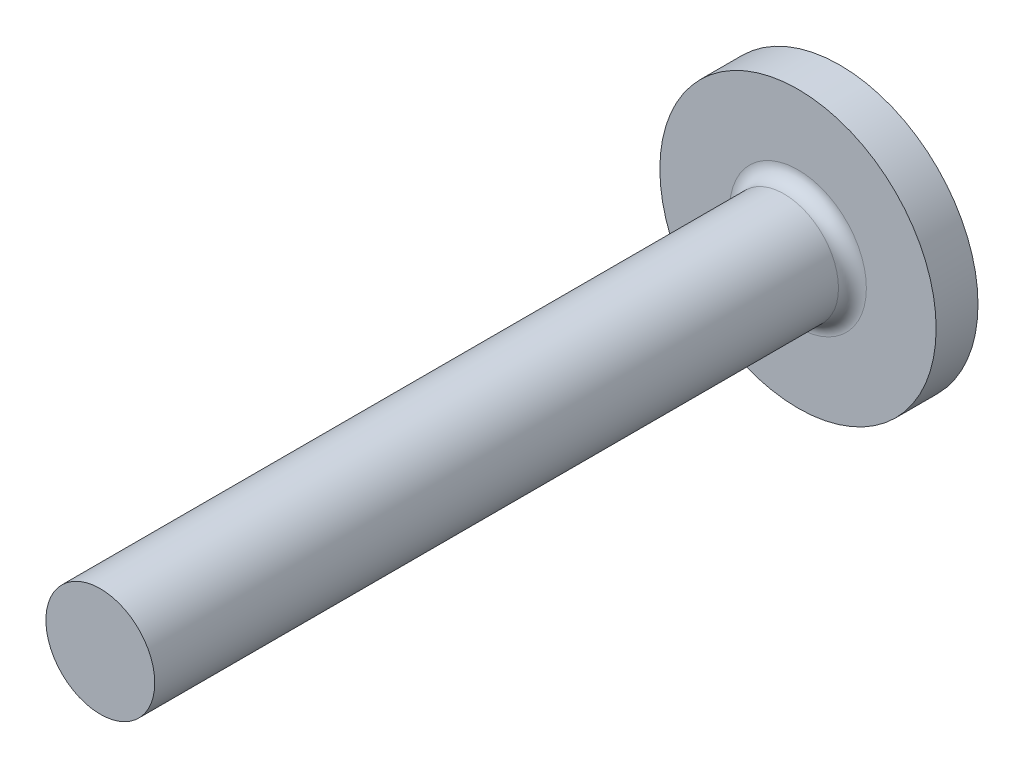
ISO-10303-21;
HEADER;
FILE_DESCRIPTION(('STEP AP214'),'2;1');
FILE_NAME('part.step','',(''),(''),'','','');
FILE_SCHEMA(('AUTOMOTIVE_DESIGN { 1 0 10303 214 1 1 1 1 }'));
ENDSEC;
DATA;
#1=APPLICATION_CONTEXT('core data for automotive mechanical design processes');
#2=APPLICATION_PROTOCOL_DEFINITION('international standard','automotive_design',2000,#1);
#3=PRODUCT_CONTEXT('',#1,'mechanical');
#4=PRODUCT('Part','Part','',(#3));
#5=PRODUCT_RELATED_PRODUCT_CATEGORY('part','',(#4));
#6=PRODUCT_DEFINITION_FORMATION('','',#4);
#7=PRODUCT_DEFINITION_CONTEXT('part definition',#1,'design');
#8=PRODUCT_DEFINITION('design','',#6,#7);
#9=PRODUCT_DEFINITION_SHAPE('','',#8);
#10=(LENGTH_UNIT() NAMED_UNIT(*) SI_UNIT(.MILLI.,.METRE.));
#11=(NAMED_UNIT(*) PLANE_ANGLE_UNIT() SI_UNIT($,.RADIAN.));
#12=(NAMED_UNIT(*) SI_UNIT($,.STERADIAN.) SOLID_ANGLE_UNIT());
#13=UNCERTAINTY_MEASURE_WITH_UNIT(LENGTH_MEASURE(1.E-05),#10,'distance_accuracy_value','');
#14=(GEOMETRIC_REPRESENTATION_CONTEXT(3) GLOBAL_UNCERTAINTY_ASSIGNED_CONTEXT((#13)) GLOBAL_UNIT_ASSIGNED_CONTEXT((#10,
#11,#12)) REPRESENTATION_CONTEXT('',''));
#15=CARTESIAN_POINT('',(0.,0.,0.));
#16=DIRECTION('',(0.,0.,1.));
#17=DIRECTION('',(1.,0.,0.));
#18=AXIS2_PLACEMENT_3D('',#15,#16,#17);
#19=CARTESIAN_POINT('',(0.,0.,50.));
#20=DIRECTION('',(0.,0.,-1.));
#21=DIRECTION('',(-1.,0.,0.));
#22=AXIS2_PLACEMENT_3D('',#19,#20,#21);
#23=CYLINDRICAL_SURFACE('',#22,3.9);
#24=CARTESIAN_POINT('',(0.,0.,1.));
#25=DIRECTION('',(0.,0.,1.));
#26=DIRECTION('',(1.,0.,0.));
#27=AXIS2_PLACEMENT_3D('',#24,#25,#26);
#28=CIRCLE('',#27,3.9);
#29=CARTESIAN_POINT('',(3.9,0.,1.));
#30=VERTEX_POINT('',#29);
#31=EDGE_CURVE('E53',#30,#30,#28,.T.);
#32=ORIENTED_EDGE('',*,*,#31,.T.);
#33=EDGE_LOOP('',(#32));
#34=FACE_BOUND('',#33,.T.);
#35=CARTESIAN_POINT('',(0.,0.,50.));
#36=DIRECTION('',(0.,0.,1.));
#37=DIRECTION('',(1.,0.,0.));
#38=AXIS2_PLACEMENT_3D('',#35,#36,#37);
#39=CIRCLE('',#38,3.9);
#40=CARTESIAN_POINT('',(3.9,0.,50.));
#41=VERTEX_POINT('',#40);
#42=EDGE_CURVE('E58',#41,#41,#39,.T.);
#43=ORIENTED_EDGE('',*,*,#42,.F.);
#44=EDGE_LOOP('',(#43));
#45=FACE_BOUND('',#44,.T.);
#46=ADVANCED_FACE('F45',(#34,#45),#23,.T.);
#47=CARTESIAN_POINT('',(0.,0.,50.));
#48=DIRECTION('',(0.,0.,1.));
#49=DIRECTION('',(1.,0.,0.));
#50=AXIS2_PLACEMENT_3D('',#47,#48,#49);
#51=PLANE('',#50);
#52=ORIENTED_EDGE('',*,*,#42,.T.);
#53=EDGE_LOOP('',(#52));
#54=FACE_BOUND('',#53,.T.);
#55=ADVANCED_FACE('F87',(#54),#51,.T.);
#56=CARTESIAN_POINT('',(0.,0.,-3.));
#57=DIRECTION('',(0.,0.,1.));
#58=DIRECTION('',(1.,0.,0.));
#59=AXIS2_PLACEMENT_3D('',#56,#57,#58);
#60=CYLINDRICAL_SURFACE('',#59,9.9);
#61=CARTESIAN_POINT('',(0.,0.,-3.));
#62=DIRECTION('',(0.,0.,1.));
#63=DIRECTION('',(1.,0.,0.));
#64=AXIS2_PLACEMENT_3D('',#61,#62,#63);
#65=CIRCLE('',#64,9.9);
#66=CARTESIAN_POINT('',(9.9,0.,-3.));
#67=VERTEX_POINT('',#66);
#68=EDGE_CURVE('E63',#67,#67,#65,.T.);
#69=ORIENTED_EDGE('',*,*,#68,.T.);
#70=EDGE_LOOP('',(#69));
#71=FACE_BOUND('',#70,.T.);
#72=CARTESIAN_POINT('',(0.,0.,0.));
#73=DIRECTION('',(0.,0.,1.));
#74=DIRECTION('',(1.,0.,0.));
#75=AXIS2_PLACEMENT_3D('',#72,#73,#74);
#76=CIRCLE('',#75,9.9);
#77=CARTESIAN_POINT('',(9.9,0.,0.));
#78=VERTEX_POINT('',#77);
#79=EDGE_CURVE('E66',#78,#78,#76,.T.);
#80=ORIENTED_EDGE('',*,*,#79,.F.);
#81=EDGE_LOOP('',(#80));
#82=FACE_BOUND('',#81,.T.);
#83=ADVANCED_FACE('F74',(#71,#82),#60,.T.);
#84=CARTESIAN_POINT('',(0.,0.,-3.));
#85=DIRECTION('',(0.,0.,1.));
#86=DIRECTION('',(1.,0.,0.));
#87=AXIS2_PLACEMENT_3D('',#84,#85,#86);
#88=PLANE('',#87);
#89=ORIENTED_EDGE('',*,*,#68,.F.);
#90=EDGE_LOOP('',(#89));
#91=FACE_BOUND('',#90,.T.);
#92=ADVANCED_FACE('F77',(#91),#88,.F.);
#93=CARTESIAN_POINT('',(0.,0.,0.));
#94=DIRECTION('',(0.,0.,1.));
#95=DIRECTION('',(1.,0.,0.));
#96=AXIS2_PLACEMENT_3D('',#93,#94,#95);
#97=PLANE('',#96);
#98=CARTESIAN_POINT('',(0.,0.,0.));
#99=DIRECTION('',(0.,0.,1.));
#100=DIRECTION('',(1.,0.,0.));
#101=AXIS2_PLACEMENT_3D('',#98,#99,#100);
#102=CIRCLE('',#101,4.9);
#103=CARTESIAN_POINT('',(4.9,0.,0.));
#104=VERTEX_POINT('',#103);
#105=EDGE_CURVE('E10',#104,#104,#102,.F.);
#106=ORIENTED_EDGE('',*,*,#105,.T.);
#107=EDGE_LOOP('',(#106));
#108=FACE_BOUND('',#107,.T.);
#109=ORIENTED_EDGE('',*,*,#79,.T.);
#110=EDGE_LOOP('',(#109));
#111=FACE_BOUND('',#110,.T.);
#112=ADVANCED_FACE('F79',(#108,#111),#97,.T.);
#113=CARTESIAN_POINT('',(0.,0.,1.));
#114=DIRECTION('',(0.,0.,1.));
#115=DIRECTION('',(1.,0.,0.));
#116=AXIS2_PLACEMENT_3D('',#113,#114,#115);
#117=TOROIDAL_SURFACE('',#116,4.9,1.);
#118=ORIENTED_EDGE('',*,*,#105,.F.);
#119=EDGE_LOOP('',(#118));
#120=FACE_BOUND('',#119,.T.);
#121=ORIENTED_EDGE('',*,*,#31,.F.);
#122=EDGE_LOOP('',(#121));
#123=FACE_BOUND('',#122,.T.);
#124=ADVANCED_FACE('F47',(#120,#123),#117,.F.);
#125=CLOSED_SHELL('',(#46,#55,#83,#92,#112,#124));
#126=MANIFOLD_SOLID_BREP('B2',#125);
#127=ADVANCED_BREP_SHAPE_REPRESENTATION('',(#18,#126),#14);
#128=SHAPE_DEFINITION_REPRESENTATION(#9,#127);
ENDSEC;
END-ISO-10303-21;
